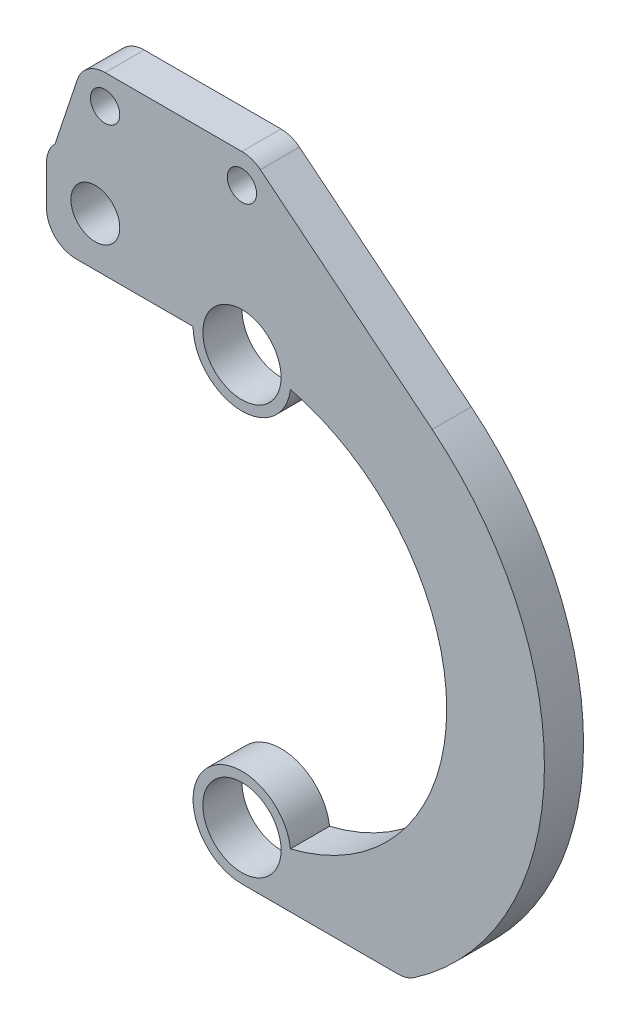
ISO-10303-21;
HEADER;
FILE_DESCRIPTION(('STEP AP214'),'2;1');
FILE_NAME('part.step','',(''),(''),'','','');
FILE_SCHEMA(('AUTOMOTIVE_DESIGN { 1 0 10303 214 1 1 1 1 }'));
ENDSEC;
DATA;
#1=APPLICATION_CONTEXT('core data for automotive mechanical design processes');
#2=APPLICATION_PROTOCOL_DEFINITION('international standard','automotive_design',2000,#1);
#3=PRODUCT_CONTEXT('',#1,'mechanical');
#4=PRODUCT('Part','Part','',(#3));
#5=PRODUCT_RELATED_PRODUCT_CATEGORY('part','',(#4));
#6=PRODUCT_DEFINITION_FORMATION('','',#4);
#7=PRODUCT_DEFINITION_CONTEXT('part definition',#1,'design');
#8=PRODUCT_DEFINITION('design','',#6,#7);
#9=PRODUCT_DEFINITION_SHAPE('','',#8);
#10=(LENGTH_UNIT() NAMED_UNIT(*) SI_UNIT(.MILLI.,.METRE.));
#11=(NAMED_UNIT(*) PLANE_ANGLE_UNIT() SI_UNIT($,.RADIAN.));
#12=(NAMED_UNIT(*) SI_UNIT($,.STERADIAN.) SOLID_ANGLE_UNIT());
#13=UNCERTAINTY_MEASURE_WITH_UNIT(LENGTH_MEASURE(1.E-05),#10,'distance_accuracy_value','');
#14=(GEOMETRIC_REPRESENTATION_CONTEXT(3) GLOBAL_UNCERTAINTY_ASSIGNED_CONTEXT((#13)) GLOBAL_UNIT_ASSIGNED_CONTEXT((#10,
#11,#12)) REPRESENTATION_CONTEXT('',''));
#15=CARTESIAN_POINT('',(0.,0.,0.));
#16=DIRECTION('',(0.,0.,1.));
#17=DIRECTION('',(1.,0.,0.));
#18=AXIS2_PLACEMENT_3D('',#15,#16,#17);
#19=CARTESIAN_POINT('',(-26.2297262447128,8.7412550388306,4.));
#20=DIRECTION('',(0.948704856693015,-0.316163082739092,0.));
#21=DIRECTION('',(0.316163082739092,0.948704856693015,0.));
#22=AXIS2_PLACEMENT_3D('',#19,#20,#21);
#23=PLANE('',#22);
#24=DIRECTION('',(-0.316163082739092,-0.948704856693015,0.));
#25=VECTOR('',#24,1.);
#26=CARTESIAN_POINT('',(-26.2297262447128,8.7412550388306,0.));
#27=LINE('',#26,#25);
#28=CARTESIAN_POINT('',(-16.846114570079,36.8984892482173,0.));
#29=VERTEX_POINT('',#28);
#30=CARTESIAN_POINT('',(-19.1213203435596,30.0713203435596,0.));
#31=VERTEX_POINT('',#30);
#32=EDGE_CURVE('E186',#29,#31,#27,.T.);
#33=ORIENTED_EDGE('',*,*,#32,.T.);
#34=DIRECTION('',(0.,0.,-1.));
#35=VECTOR('',#34,1.);
#36=CARTESIAN_POINT('',(-19.1213203435596,30.0713203435596,4.));
#37=LINE('',#36,#35);
#38=CARTESIAN_POINT('',(-19.1213203435596,30.0713203435596,4.));
#39=VERTEX_POINT('',#38);
#40=EDGE_CURVE('E11',#39,#31,#37,.T.);
#41=ORIENTED_EDGE('',*,*,#40,.F.);
#42=DIRECTION('',(-0.316163082739092,-0.948704856693015,0.));
#43=VECTOR('',#42,1.);
#44=CARTESIAN_POINT('',(-26.2297262447128,8.7412550388306,4.));
#45=LINE('',#44,#43);
#46=CARTESIAN_POINT('',(-16.846114570079,36.8984892482173,4.));
#47=VERTEX_POINT('',#46);
#48=EDGE_CURVE('E238',#47,#39,#45,.T.);
#49=ORIENTED_EDGE('',*,*,#48,.F.);
#50=DIRECTION('',(0.,0.,-1.));
#51=VECTOR('',#50,1.);
#52=CARTESIAN_POINT('',(-16.846114570079,36.8984892482173,4.));
#53=LINE('',#52,#51);
#54=EDGE_CURVE('E185',#47,#29,#53,.T.);
#55=ORIENTED_EDGE('',*,*,#54,.T.);
#56=EDGE_LOOP('',(#33,#41,#49,#55));
#57=FACE_BOUND('',#56,.T.);
#58=ADVANCED_FACE('F34',(#57),#23,.F.);
#59=CARTESIAN_POINT('',(-17.,27.95,4.));
#60=DIRECTION('',(0.,0.,-1.));
#61=DIRECTION('',(-1.,0.,0.));
#62=AXIS2_PLACEMENT_3D('',#59,#60,#61);
#63=CYLINDRICAL_SURFACE('',#62,3.);
#64=CARTESIAN_POINT('',(-17.,27.95,0.));
#65=DIRECTION('',(0.,0.,1.));
#66=DIRECTION('',(1.,0.,0.));
#67=AXIS2_PLACEMENT_3D('',#64,#65,#66);
#68=CIRCLE('',#67,3.);
#69=CARTESIAN_POINT('',(-20.,27.95,0.));
#70=VERTEX_POINT('',#69);
#71=EDGE_CURVE('E189',#31,#70,#68,.T.);
#72=ORIENTED_EDGE('',*,*,#71,.T.);
#73=DIRECTION('',(0.,0.,-1.));
#74=VECTOR('',#73,1.);
#75=CARTESIAN_POINT('',(-20.,27.95,4.));
#76=LINE('',#75,#74);
#77=CARTESIAN_POINT('',(-20.,27.95,4.));
#78=VERTEX_POINT('',#77);
#79=EDGE_CURVE('E42',#78,#70,#76,.T.);
#80=ORIENTED_EDGE('',*,*,#79,.F.);
#81=CARTESIAN_POINT('',(-17.,27.95,4.));
#82=DIRECTION('',(0.,0.,1.));
#83=DIRECTION('',(1.,0.,0.));
#84=AXIS2_PLACEMENT_3D('',#81,#82,#83);
#85=CIRCLE('',#84,3.);
#86=EDGE_CURVE('E110',#39,#78,#85,.T.);
#87=ORIENTED_EDGE('',*,*,#86,.F.);
#88=ORIENTED_EDGE('',*,*,#40,.T.);
#89=EDGE_LOOP('',(#72,#80,#87,#88));
#90=FACE_BOUND('',#89,.T.);
#91=ADVANCED_FACE('F268',(#90),#63,.T.);
#92=CARTESIAN_POINT('',(-20.,0.,4.));
#93=DIRECTION('',(-1.,0.,0.));
#94=DIRECTION('',(0.,0.,1.));
#95=AXIS2_PLACEMENT_3D('',#92,#93,#94);
#96=PLANE('',#95);
#97=DIRECTION('',(0.,1.,0.));
#98=VECTOR('',#97,1.);
#99=CARTESIAN_POINT('',(-20.,0.,0.));
#100=LINE('',#99,#98);
#101=CARTESIAN_POINT('',(-20.,23.95,0.));
#102=VERTEX_POINT('',#101);
#103=EDGE_CURVE('E192',#102,#70,#100,.T.);
#104=ORIENTED_EDGE('',*,*,#103,.F.);
#105=DIRECTION('',(0.,0.,-1.));
#106=VECTOR('',#105,1.);
#107=CARTESIAN_POINT('',(-20.,23.95,4.));
#108=LINE('',#107,#106);
#109=CARTESIAN_POINT('',(-20.,23.95,4.));
#110=VERTEX_POINT('',#109);
#111=EDGE_CURVE('E261',#110,#102,#108,.T.);
#112=ORIENTED_EDGE('',*,*,#111,.F.);
#113=DIRECTION('',(0.,1.,0.));
#114=VECTOR('',#113,1.);
#115=CARTESIAN_POINT('',(-20.,0.,4.));
#116=LINE('',#115,#114);
#117=EDGE_CURVE('E267',#110,#78,#116,.T.);
#118=ORIENTED_EDGE('',*,*,#117,.T.);
#119=ORIENTED_EDGE('',*,*,#79,.T.);
#120=EDGE_LOOP('',(#104,#112,#118,#119));
#121=FACE_BOUND('',#120,.T.);
#122=ADVANCED_FACE('F265',(#121),#96,.T.);
#123=CARTESIAN_POINT('',(-17.,23.95,4.));
#124=DIRECTION('',(0.,0.,-1.));
#125=DIRECTION('',(-1.,0.,0.));
#126=AXIS2_PLACEMENT_3D('',#123,#124,#125);
#127=CYLINDRICAL_SURFACE('',#126,3.);
#128=CARTESIAN_POINT('',(-17.,23.95,0.));
#129=DIRECTION('',(0.,0.,1.));
#130=DIRECTION('',(1.,0.,0.));
#131=AXIS2_PLACEMENT_3D('',#128,#129,#130);
#132=CIRCLE('',#131,3.);
#133=CARTESIAN_POINT('',(-17.,20.95,0.));
#134=VERTEX_POINT('',#133);
#135=EDGE_CURVE('E195',#134,#102,#132,.F.);
#136=ORIENTED_EDGE('',*,*,#135,.F.);
#137=DIRECTION('',(0.,0.,-1.));
#138=VECTOR('',#137,1.);
#139=CARTESIAN_POINT('',(-17.,20.95,4.));
#140=LINE('',#139,#138);
#141=CARTESIAN_POINT('',(-17.,20.95,4.));
#142=VERTEX_POINT('',#141);
#143=EDGE_CURVE('E259',#142,#134,#140,.T.);
#144=ORIENTED_EDGE('',*,*,#143,.F.);
#145=CARTESIAN_POINT('',(-17.,23.95,4.));
#146=DIRECTION('',(0.,0.,1.));
#147=DIRECTION('',(1.,0.,0.));
#148=AXIS2_PLACEMENT_3D('',#145,#146,#147);
#149=CIRCLE('',#148,3.);
#150=EDGE_CURVE('E281',#142,#110,#149,.F.);
#151=ORIENTED_EDGE('',*,*,#150,.T.);
#152=ORIENTED_EDGE('',*,*,#111,.T.);
#153=EDGE_LOOP('',(#136,#144,#151,#152));
#154=FACE_BOUND('',#153,.T.);
#155=ADVANCED_FACE('F278',(#154),#127,.T.);
#156=CARTESIAN_POINT('',(0.,20.95,4.));
#157=DIRECTION('',(0.,-1.,0.));
#158=DIRECTION('',(1.,0.,0.));
#159=AXIS2_PLACEMENT_3D('',#156,#157,#158);
#160=PLANE('',#159);
#161=DIRECTION('',(-1.,0.,0.));
#162=VECTOR('',#161,1.);
#163=CARTESIAN_POINT('',(0.,20.95,0.));
#164=LINE('',#163,#162);
#165=CARTESIAN_POINT('',(-5.,20.95,0.));
#166=VERTEX_POINT('',#165);
#167=EDGE_CURVE('E198',#166,#134,#164,.T.);
#168=ORIENTED_EDGE('',*,*,#167,.F.);
#169=DIRECTION('',(0.,0.,-1.));
#170=VECTOR('',#169,1.);
#171=CARTESIAN_POINT('',(-5.,20.95,4.));
#172=LINE('',#171,#170);
#173=CARTESIAN_POINT('',(-5.,20.95,4.));
#174=VERTEX_POINT('',#173);
#175=EDGE_CURVE('E257',#174,#166,#172,.T.);
#176=ORIENTED_EDGE('',*,*,#175,.F.);
#177=DIRECTION('',(-1.,0.,0.));
#178=VECTOR('',#177,1.);
#179=CARTESIAN_POINT('',(0.,20.95,4.));
#180=LINE('',#179,#178);
#181=EDGE_CURVE('E285',#174,#142,#180,.T.);
#182=ORIENTED_EDGE('',*,*,#181,.T.);
#183=ORIENTED_EDGE('',*,*,#143,.T.);
#184=EDGE_LOOP('',(#168,#176,#182,#183));
#185=FACE_BOUND('',#184,.T.);
#186=ADVANCED_FACE('F336',(#185),#160,.T.);
#187=CARTESIAN_POINT('',(0.,20.95,4.));
#188=DIRECTION('',(0.,0.,-1.));
#189=DIRECTION('',(-1.,0.,0.));
#190=AXIS2_PLACEMENT_3D('',#187,#188,#189);
#191=CYLINDRICAL_SURFACE('',#190,5.);
#192=CARTESIAN_POINT('',(0.,20.95,0.));
#193=DIRECTION('',(0.,0.,1.));
#194=DIRECTION('',(1.,0.,0.));
#195=AXIS2_PLACEMENT_3D('',#192,#193,#194);
#196=CIRCLE('',#195,5.);
#197=CARTESIAN_POINT('',(4.96427219059639,20.3533412887828,0.));
#198=VERTEX_POINT('',#197);
#199=EDGE_CURVE('E201',#166,#198,#196,.T.);
#200=ORIENTED_EDGE('',*,*,#199,.T.);
#201=DIRECTION('',(0.,0.,-1.));
#202=VECTOR('',#201,1.);
#203=CARTESIAN_POINT('',(4.96427219059639,20.3533412887828,4.));
#204=LINE('',#203,#202);
#205=CARTESIAN_POINT('',(4.96427219059639,20.3533412887828,4.));
#206=VERTEX_POINT('',#205);
#207=EDGE_CURVE('E255',#206,#198,#204,.T.);
#208=ORIENTED_EDGE('',*,*,#207,.F.);
#209=CARTESIAN_POINT('',(0.,20.95,4.));
#210=DIRECTION('',(0.,0.,1.));
#211=DIRECTION('',(1.,0.,0.));
#212=AXIS2_PLACEMENT_3D('',#209,#210,#211);
#213=CIRCLE('',#212,5.);
#214=EDGE_CURVE('E291',#174,#206,#213,.T.);
#215=ORIENTED_EDGE('',*,*,#214,.F.);
#216=ORIENTED_EDGE('',*,*,#175,.T.);
#217=EDGE_LOOP('',(#200,#208,#215,#216));
#218=FACE_BOUND('',#217,.T.);
#219=ADVANCED_FACE('F339',(#218),#191,.T.);
#220=CARTESIAN_POINT('',(0.,0.,4.));
#221=DIRECTION('',(0.,0.,-1.));
#222=DIRECTION('',(-1.,0.,0.));
#223=AXIS2_PLACEMENT_3D('',#220,#221,#222);
#224=CYLINDRICAL_SURFACE('',#223,20.95);
#225=CARTESIAN_POINT('',(0.,0.,0.));
#226=DIRECTION('',(0.,0.,1.));
#227=DIRECTION('',(1.,0.,0.));
#228=AXIS2_PLACEMENT_3D('',#225,#226,#227);
#229=CIRCLE('',#228,20.95);
#230=CARTESIAN_POINT('',(4.96427219059625,-20.3533412887829,0.));
#231=VERTEX_POINT('',#230);
#232=EDGE_CURVE('E204',#231,#198,#229,.T.);
#233=ORIENTED_EDGE('',*,*,#232,.F.);
#234=DIRECTION('',(0.,0.,-1.));
#235=VECTOR('',#234,1.);
#236=CARTESIAN_POINT('',(4.96427219059625,-20.3533412887829,4.));
#237=LINE('',#236,#235);
#238=CARTESIAN_POINT('',(4.96427219059625,-20.3533412887829,4.));
#239=VERTEX_POINT('',#238);
#240=EDGE_CURVE('E253',#239,#231,#237,.T.);
#241=ORIENTED_EDGE('',*,*,#240,.F.);
#242=CARTESIAN_POINT('',(0.,0.,4.));
#243=DIRECTION('',(0.,0.,1.));
#244=DIRECTION('',(1.,0.,0.));
#245=AXIS2_PLACEMENT_3D('',#242,#243,#244);
#246=CIRCLE('',#245,20.95);
#247=EDGE_CURVE('E293',#239,#206,#246,.T.);
#248=ORIENTED_EDGE('',*,*,#247,.T.);
#249=ORIENTED_EDGE('',*,*,#207,.T.);
#250=EDGE_LOOP('',(#233,#241,#248,#249));
#251=FACE_BOUND('',#250,.T.);
#252=ADVANCED_FACE('F343',(#251),#224,.F.);
#253=CARTESIAN_POINT('',(-1.46293068097527E-13,-20.95,4.));
#254=DIRECTION('',(0.,0.,-1.));
#255=DIRECTION('',(-1.,0.,0.));
#256=AXIS2_PLACEMENT_3D('',#253,#254,#255);
#257=CYLINDRICAL_SURFACE('',#256,5.);
#258=CARTESIAN_POINT('',(-1.46293068097527E-13,-20.95,0.));
#259=DIRECTION('',(0.,0.,1.));
#260=DIRECTION('',(1.,0.,0.));
#261=AXIS2_PLACEMENT_3D('',#258,#259,#260);
#262=CIRCLE('',#261,5.);
#263=CARTESIAN_POINT('',(-1.63750471515078E-13,-25.95,0.));
#264=VERTEX_POINT('',#263);
#265=EDGE_CURVE('E207',#231,#264,#262,.T.);
#266=ORIENTED_EDGE('',*,*,#265,.T.);
#267=DIRECTION('',(0.,0.,-1.));
#268=VECTOR('',#267,1.);
#269=CARTESIAN_POINT('',(-1.63750471515078E-13,-25.95,4.));
#270=LINE('',#269,#268);
#271=CARTESIAN_POINT('',(-1.63750471515078E-13,-25.95,4.));
#272=VERTEX_POINT('',#271);
#273=EDGE_CURVE('E250',#272,#264,#270,.T.);
#274=ORIENTED_EDGE('',*,*,#273,.F.);
#275=CARTESIAN_POINT('',(-1.46293068097527E-13,-20.95,4.));
#276=DIRECTION('',(0.,0.,1.));
#277=DIRECTION('',(1.,0.,0.));
#278=AXIS2_PLACEMENT_3D('',#275,#276,#277);
#279=CIRCLE('',#278,5.);
#280=EDGE_CURVE('E296',#239,#272,#279,.T.);
#281=ORIENTED_EDGE('',*,*,#280,.F.);
#282=ORIENTED_EDGE('',*,*,#240,.T.);
#283=EDGE_LOOP('',(#266,#274,#281,#282));
#284=FACE_BOUND('',#283,.T.);
#285=ADVANCED_FACE('F347',(#284),#257,.T.);
#286=CARTESIAN_POINT('',(0.,-25.95,4.));
#287=DIRECTION('',(0.,1.,0.));
#288=DIRECTION('',(-1.,0.,0.));
#289=AXIS2_PLACEMENT_3D('',#286,#287,#288);
#290=PLANE('',#289);
#291=DIRECTION('',(1.,0.,0.));
#292=VECTOR('',#291,1.);
#293=CARTESIAN_POINT('',(0.,-25.95,0.));
#294=LINE('',#293,#292);
#295=CARTESIAN_POINT('',(15.9530561335437,-25.9500000000001,0.));
#296=VERTEX_POINT('',#295);
#297=EDGE_CURVE('E209',#264,#296,#294,.T.);
#298=ORIENTED_EDGE('',*,*,#297,.T.);
#299=DIRECTION('',(0.,0.,-1.));
#300=VECTOR('',#299,1.);
#301=CARTESIAN_POINT('',(15.9530561335437,-25.9500000000001,4.));
#302=LINE('',#301,#300);
#303=CARTESIAN_POINT('',(15.9530561335437,-25.9500000000001,4.));
#304=VERTEX_POINT('',#303);
#305=EDGE_CURVE('E247',#304,#296,#302,.T.);
#306=ORIENTED_EDGE('',*,*,#305,.F.);
#307=DIRECTION('',(1.,0.,0.));
#308=VECTOR('',#307,1.);
#309=CARTESIAN_POINT('',(0.,-25.95,4.));
#310=LINE('',#309,#308);
#311=EDGE_CURVE('E298',#272,#304,#310,.T.);
#312=ORIENTED_EDGE('',*,*,#311,.F.);
#313=ORIENTED_EDGE('',*,*,#273,.T.);
#314=EDGE_LOOP('',(#298,#306,#312,#313));
#315=FACE_BOUND('',#314,.T.);
#316=ADVANCED_FACE('F351',(#315),#290,.F.);
#317=CARTESIAN_POINT('',(15.9530561335437,-22.9500000000001,4.));
#318=DIRECTION('',(0.,0.,-1.));
#319=DIRECTION('',(-1.,0.,0.));
#320=AXIS2_PLACEMENT_3D('',#317,#318,#319);
#321=CYLINDRICAL_SURFACE('',#320,3.);
#322=CARTESIAN_POINT('',(15.9530561335437,-22.9500000000001,0.));
#323=DIRECTION('',(0.,0.,1.));
#324=DIRECTION('',(1.,0.,0.));
#325=AXIS2_PLACEMENT_3D('',#322,#323,#324);
#326=CIRCLE('',#325,3.);
#327=CARTESIAN_POINT('',(17.6653698509187,-25.4133273703042,0.));
#328=VERTEX_POINT('',#327);
#329=EDGE_CURVE('E211',#296,#328,#326,.T.);
#330=ORIENTED_EDGE('',*,*,#329,.T.);
#331=DIRECTION('',(0.,0.,-1.));
#332=VECTOR('',#331,1.);
#333=CARTESIAN_POINT('',(17.6653698509187,-25.4133273703042,4.));
#334=LINE('',#333,#332);
#335=CARTESIAN_POINT('',(17.6653698509187,-25.4133273703042,4.));
#336=VERTEX_POINT('',#335);
#337=EDGE_CURVE('E244',#336,#328,#334,.T.);
#338=ORIENTED_EDGE('',*,*,#337,.F.);
#339=CARTESIAN_POINT('',(15.9530561335437,-22.9500000000001,4.));
#340=DIRECTION('',(0.,0.,1.));
#341=DIRECTION('',(1.,0.,0.));
#342=AXIS2_PLACEMENT_3D('',#339,#340,#341);
#343=CIRCLE('',#342,3.);
#344=EDGE_CURVE('E300',#304,#336,#343,.T.);
#345=ORIENTED_EDGE('',*,*,#344,.F.);
#346=ORIENTED_EDGE('',*,*,#305,.T.);
#347=EDGE_LOOP('',(#330,#338,#345,#346));
#348=FACE_BOUND('',#347,.T.);
#349=ADVANCED_FACE('F355',(#348),#321,.T.);
#350=CARTESIAN_POINT('',(0.,0.,4.));
#351=DIRECTION('',(0.,0.,-1.));
#352=DIRECTION('',(-1.,0.,0.));
#353=AXIS2_PLACEMENT_3D('',#350,#351,#352);
#354=CYLINDRICAL_SURFACE('',#353,30.95);
#355=CARTESIAN_POINT('',(0.,0.,0.));
#356=DIRECTION('',(0.,0.,1.));
#357=DIRECTION('',(1.,0.,0.));
#358=AXIS2_PLACEMENT_3D('',#355,#356,#357);
#359=CIRCLE('',#358,30.95);
#360=CARTESIAN_POINT('',(19.4651242928461,24.0626564673157,0.));
#361=VERTEX_POINT('',#360);
#362=EDGE_CURVE('E213',#328,#361,#359,.T.);
#363=ORIENTED_EDGE('',*,*,#362,.T.);
#364=DIRECTION('',(0.,0.,-1.));
#365=VECTOR('',#364,1.);
#366=CARTESIAN_POINT('',(19.4651242928461,24.0626564673157,4.));
#367=LINE('',#366,#365);
#368=CARTESIAN_POINT('',(19.4651242928461,24.0626564673157,4.));
#369=VERTEX_POINT('',#368);
#370=EDGE_CURVE('E242',#369,#361,#367,.T.);
#371=ORIENTED_EDGE('',*,*,#370,.F.);
#372=CARTESIAN_POINT('',(0.,0.,4.));
#373=DIRECTION('',(0.,0.,1.));
#374=DIRECTION('',(1.,0.,0.));
#375=AXIS2_PLACEMENT_3D('',#372,#373,#374);
#376=CIRCLE('',#375,30.95);
#377=EDGE_CURVE('E302',#336,#369,#376,.T.);
#378=ORIENTED_EDGE('',*,*,#377,.F.);
#379=ORIENTED_EDGE('',*,*,#337,.T.);
#380=EDGE_LOOP('',(#363,#371,#378,#379));
#381=FACE_BOUND('',#380,.T.);
#382=ADVANCED_FACE('F359',(#381),#354,.T.);
#383=CARTESIAN_POINT('',(19.4651242928461,24.0626564673157,4.));
#384=DIRECTION('',(0.628921624970796,0.777468706536857,0.));
#385=DIRECTION('',(-0.777468706536857,0.628921624970796,0.));
#386=AXIS2_PLACEMENT_3D('',#383,#384,#385);
#387=PLANE('',#386);
#388=DIRECTION('',(0.777468706536857,-0.628921624970796,0.));
#389=VECTOR('',#388,1.);
#390=CARTESIAN_POINT('',(19.4651242928461,24.0626564673157,0.));
#391=LINE('',#390,#389);
#392=CARTESIAN_POINT('',(1.88676487491238,38.2824061196106,0.));
#393=VERTEX_POINT('',#392);
#394=EDGE_CURVE('E216',#393,#361,#391,.T.);
#395=ORIENTED_EDGE('',*,*,#394,.F.);
#396=DIRECTION('',(0.,0.,-1.));
#397=VECTOR('',#396,1.);
#398=CARTESIAN_POINT('',(1.88676487491238,38.2824061196106,4.));
#399=LINE('',#398,#397);
#400=CARTESIAN_POINT('',(1.88676487491238,38.2824061196106,4.));
#401=VERTEX_POINT('',#400);
#402=EDGE_CURVE('E163',#401,#393,#399,.T.);
#403=ORIENTED_EDGE('',*,*,#402,.F.);
#404=DIRECTION('',(0.777468706536857,-0.628921624970796,0.));
#405=VECTOR('',#404,1.);
#406=CARTESIAN_POINT('',(19.4651242928461,24.0626564673157,4.));
#407=LINE('',#406,#405);
#408=EDGE_CURVE('E152',#401,#369,#407,.T.);
#409=ORIENTED_EDGE('',*,*,#408,.T.);
#410=ORIENTED_EDGE('',*,*,#370,.T.);
#411=EDGE_LOOP('',(#395,#403,#409,#410));
#412=FACE_BOUND('',#411,.T.);
#413=ADVANCED_FACE('F305',(#412),#387,.T.);
#414=CARTESIAN_POINT('',(0.,35.95,4.));
#415=DIRECTION('',(0.,0.,-1.));
#416=DIRECTION('',(-1.,0.,0.));
#417=AXIS2_PLACEMENT_3D('',#414,#415,#416);
#418=CYLINDRICAL_SURFACE('',#417,3.);
#419=CARTESIAN_POINT('',(0.,35.95,0.));
#420=DIRECTION('',(0.,0.,1.));
#421=DIRECTION('',(1.,0.,0.));
#422=AXIS2_PLACEMENT_3D('',#419,#420,#421);
#423=CIRCLE('',#422,3.);
#424=CARTESIAN_POINT('',(0.,38.95,0.));
#425=VERTEX_POINT('',#424);
#426=EDGE_CURVE('E159',#393,#425,#423,.T.);
#427=ORIENTED_EDGE('',*,*,#426,.T.);
#428=DIRECTION('',(0.,0.,-1.));
#429=VECTOR('',#428,1.);
#430=CARTESIAN_POINT('',(0.,38.95,4.));
#431=LINE('',#430,#429);
#432=CARTESIAN_POINT('',(0.,38.95,4.));
#433=VERTEX_POINT('',#432);
#434=EDGE_CURVE('E156',#433,#425,#431,.T.);
#435=ORIENTED_EDGE('',*,*,#434,.F.);
#436=CARTESIAN_POINT('',(0.,35.95,4.));
#437=DIRECTION('',(0.,0.,1.));
#438=DIRECTION('',(1.,0.,0.));
#439=AXIS2_PLACEMENT_3D('',#436,#437,#438);
#440=CIRCLE('',#439,3.);
#441=EDGE_CURVE('E145',#401,#433,#440,.T.);
#442=ORIENTED_EDGE('',*,*,#441,.F.);
#443=ORIENTED_EDGE('',*,*,#402,.T.);
#444=EDGE_LOOP('',(#427,#435,#442,#443));
#445=FACE_BOUND('',#444,.T.);
#446=ADVANCED_FACE('F157',(#445),#418,.T.);
#447=CARTESIAN_POINT('',(0.,38.95,4.));
#448=DIRECTION('',(0.,1.,0.));
#449=DIRECTION('',(0.,0.,1.));
#450=AXIS2_PLACEMENT_3D('',#447,#448,#449);
#451=PLANE('',#450);
#452=DIRECTION('',(1.,0.,0.));
#453=VECTOR('',#452,1.);
#454=CARTESIAN_POINT('',(0.,38.95,0.));
#455=LINE('',#454,#453);
#456=CARTESIAN_POINT('',(-14.,38.95,0.));
#457=VERTEX_POINT('',#456);
#458=EDGE_CURVE('E220',#457,#425,#455,.T.);
#459=ORIENTED_EDGE('',*,*,#458,.F.);
#460=DIRECTION('',(0.,0.,-1.));
#461=VECTOR('',#460,1.);
#462=CARTESIAN_POINT('',(-14.,38.95,4.));
#463=LINE('',#462,#461);
#464=CARTESIAN_POINT('',(-14.,38.95,4.));
#465=VERTEX_POINT('',#464);
#466=EDGE_CURVE('E99',#465,#457,#463,.T.);
#467=ORIENTED_EDGE('',*,*,#466,.F.);
#468=DIRECTION('',(1.,0.,0.));
#469=VECTOR('',#468,1.);
#470=CARTESIAN_POINT('',(0.,38.95,4.));
#471=LINE('',#470,#469);
#472=EDGE_CURVE('E150',#465,#433,#471,.T.);
#473=ORIENTED_EDGE('',*,*,#472,.T.);
#474=ORIENTED_EDGE('',*,*,#434,.T.);
#475=EDGE_LOOP('',(#459,#467,#473,#474));
#476=FACE_BOUND('',#475,.T.);
#477=ADVANCED_FACE('F165',(#476),#451,.T.);
#478=CARTESIAN_POINT('',(-14.,35.95,4.));
#479=DIRECTION('',(0.,0.,-1.));
#480=DIRECTION('',(-1.,0.,0.));
#481=AXIS2_PLACEMENT_3D('',#478,#479,#480);
#482=CYLINDRICAL_SURFACE('',#481,1.5);
#483=CARTESIAN_POINT('',(-14.,35.95,4.));
#484=DIRECTION('',(0.,0.,1.));
#485=DIRECTION('',(1.,0.,0.));
#486=AXIS2_PLACEMENT_3D('',#483,#484,#485);
#487=CIRCLE('',#486,1.5);
#488=CARTESIAN_POINT('',(-12.5,35.95,4.));
#489=VERTEX_POINT('',#488);
#490=EDGE_CURVE('E179',#489,#489,#487,.T.);
#491=ORIENTED_EDGE('',*,*,#490,.T.);
#492=EDGE_LOOP('',(#491));
#493=FACE_BOUND('',#492,.T.);
#494=CARTESIAN_POINT('',(-14.,35.95,0.));
#495=DIRECTION('',(0.,0.,1.));
#496=DIRECTION('',(1.,0.,0.));
#497=AXIS2_PLACEMENT_3D('',#494,#495,#496);
#498=CIRCLE('',#497,1.5);
#499=CARTESIAN_POINT('',(-12.5,35.95,0.));
#500=VERTEX_POINT('',#499);
#501=EDGE_CURVE('E232',#500,#500,#498,.T.);
#502=ORIENTED_EDGE('',*,*,#501,.F.);
#503=EDGE_LOOP('',(#502));
#504=FACE_BOUND('',#503,.T.);
#505=ADVANCED_FACE('F368',(#493,#504),#482,.F.);
#506=CARTESIAN_POINT('',(-15.,25.95,4.));
#507=DIRECTION('',(0.,0.,-1.));
#508=DIRECTION('',(-1.,0.,0.));
#509=AXIS2_PLACEMENT_3D('',#506,#507,#508);
#510=CYLINDRICAL_SURFACE('',#509,2.5);
#511=CARTESIAN_POINT('',(-15.,25.95,4.));
#512=DIRECTION('',(0.,0.,1.));
#513=DIRECTION('',(1.,0.,0.));
#514=AXIS2_PLACEMENT_3D('',#511,#512,#513);
#515=CIRCLE('',#514,2.5);
#516=CARTESIAN_POINT('',(-12.5,25.95,4.));
#517=VERTEX_POINT('',#516);
#518=EDGE_CURVE('E176',#517,#517,#515,.T.);
#519=ORIENTED_EDGE('',*,*,#518,.T.);
#520=EDGE_LOOP('',(#519));
#521=FACE_BOUND('',#520,.T.);
#522=CARTESIAN_POINT('',(-15.,25.95,0.));
#523=DIRECTION('',(0.,0.,1.));
#524=DIRECTION('',(1.,0.,0.));
#525=AXIS2_PLACEMENT_3D('',#522,#523,#524);
#526=CIRCLE('',#525,2.5);
#527=CARTESIAN_POINT('',(-12.5,25.95,0.));
#528=VERTEX_POINT('',#527);
#529=EDGE_CURVE('E229',#528,#528,#526,.T.);
#530=ORIENTED_EDGE('',*,*,#529,.F.);
#531=EDGE_LOOP('',(#530));
#532=FACE_BOUND('',#531,.T.);
#533=ADVANCED_FACE('F372',(#521,#532),#510,.F.);
#534=CARTESIAN_POINT('',(-1.46293068097527E-13,-20.95,4.));
#535=DIRECTION('',(0.,0.,-1.));
#536=DIRECTION('',(-1.,0.,0.));
#537=AXIS2_PLACEMENT_3D('',#534,#535,#536);
#538=CYLINDRICAL_SURFACE('',#537,4.);
#539=CARTESIAN_POINT('',(-1.46293068097527E-13,-20.95,4.));
#540=DIRECTION('',(0.,0.,1.));
#541=DIRECTION('',(1.,0.,0.));
#542=AXIS2_PLACEMENT_3D('',#539,#540,#541);
#543=CIRCLE('',#542,4.);
#544=CARTESIAN_POINT('',(3.99999999999986,-20.95,4.));
#545=VERTEX_POINT('',#544);
#546=EDGE_CURVE('E173',#545,#545,#543,.T.);
#547=ORIENTED_EDGE('',*,*,#546,.T.);
#548=EDGE_LOOP('',(#547));
#549=FACE_BOUND('',#548,.T.);
#550=CARTESIAN_POINT('',(-1.46293068097527E-13,-20.95,0.));
#551=DIRECTION('',(0.,0.,1.));
#552=DIRECTION('',(1.,0.,0.));
#553=AXIS2_PLACEMENT_3D('',#550,#551,#552);
#554=CIRCLE('',#553,4.);
#555=CARTESIAN_POINT('',(3.99999999999986,-20.95,0.));
#556=VERTEX_POINT('',#555);
#557=EDGE_CURVE('E226',#556,#556,#554,.T.);
#558=ORIENTED_EDGE('',*,*,#557,.F.);
#559=EDGE_LOOP('',(#558));
#560=FACE_BOUND('',#559,.T.);
#561=ADVANCED_FACE('F321',(#549,#560),#538,.F.);
#562=CARTESIAN_POINT('',(0.,20.95,4.));
#563=DIRECTION('',(0.,0.,-1.));
#564=DIRECTION('',(-1.,0.,0.));
#565=AXIS2_PLACEMENT_3D('',#562,#563,#564);
#566=CYLINDRICAL_SURFACE('',#565,4.);
#567=CARTESIAN_POINT('',(0.,20.95,4.));
#568=DIRECTION('',(0.,0.,1.));
#569=DIRECTION('',(1.,0.,0.));
#570=AXIS2_PLACEMENT_3D('',#567,#568,#569);
#571=CIRCLE('',#570,4.);
#572=CARTESIAN_POINT('',(4.,20.95,4.));
#573=VERTEX_POINT('',#572);
#574=EDGE_CURVE('E167',#573,#573,#571,.T.);
#575=ORIENTED_EDGE('',*,*,#574,.T.);
#576=EDGE_LOOP('',(#575));
#577=FACE_BOUND('',#576,.T.);
#578=CARTESIAN_POINT('',(0.,20.95,0.));
#579=DIRECTION('',(0.,0.,1.));
#580=DIRECTION('',(1.,0.,0.));
#581=AXIS2_PLACEMENT_3D('',#578,#579,#580);
#582=CIRCLE('',#581,4.);
#583=CARTESIAN_POINT('',(4.,20.95,0.));
#584=VERTEX_POINT('',#583);
#585=EDGE_CURVE('E223',#584,#584,#582,.T.);
#586=ORIENTED_EDGE('',*,*,#585,.F.);
#587=EDGE_LOOP('',(#586));
#588=FACE_BOUND('',#587,.T.);
#589=ADVANCED_FACE('F313',(#577,#588),#566,.F.);
#590=CARTESIAN_POINT('',(-14.,35.95,4.));
#591=DIRECTION('',(0.,0.,-1.));
#592=DIRECTION('',(-1.,0.,0.));
#593=AXIS2_PLACEMENT_3D('',#590,#591,#592);
#594=CYLINDRICAL_SURFACE('',#593,3.);
#595=CARTESIAN_POINT('',(-14.,35.95,0.));
#596=DIRECTION('',(0.,0.,1.));
#597=DIRECTION('',(1.,0.,0.));
#598=AXIS2_PLACEMENT_3D('',#595,#596,#597);
#599=CIRCLE('',#598,3.);
#600=EDGE_CURVE('E102',#457,#29,#599,.T.);
#601=ORIENTED_EDGE('',*,*,#600,.T.);
#602=ORIENTED_EDGE('',*,*,#54,.F.);
#603=CARTESIAN_POINT('',(-14.,35.95,4.));
#604=DIRECTION('',(0.,0.,1.));
#605=DIRECTION('',(1.,0.,0.));
#606=AXIS2_PLACEMENT_3D('',#603,#604,#605);
#607=CIRCLE('',#606,3.);
#608=EDGE_CURVE('E50',#465,#47,#607,.T.);
#609=ORIENTED_EDGE('',*,*,#608,.F.);
#610=ORIENTED_EDGE('',*,*,#466,.T.);
#611=EDGE_LOOP('',(#601,#602,#609,#610));
#612=FACE_BOUND('',#611,.T.);
#613=ADVANCED_FACE('F310',(#612),#594,.T.);
#614=CARTESIAN_POINT('',(0.,35.95,4.));
#615=DIRECTION('',(0.,0.,-1.));
#616=DIRECTION('',(-1.,0.,0.));
#617=AXIS2_PLACEMENT_3D('',#614,#615,#616);
#618=CYLINDRICAL_SURFACE('',#617,1.5);
#619=CARTESIAN_POINT('',(0.,35.95,4.));
#620=DIRECTION('',(0.,0.,1.));
#621=DIRECTION('',(1.,0.,0.));
#622=AXIS2_PLACEMENT_3D('',#619,#620,#621);
#623=CIRCLE('',#622,1.5);
#624=CARTESIAN_POINT('',(1.5,35.95,4.));
#625=VERTEX_POINT('',#624);
#626=EDGE_CURVE('E182',#625,#625,#623,.T.);
#627=ORIENTED_EDGE('',*,*,#626,.T.);
#628=EDGE_LOOP('',(#627));
#629=FACE_BOUND('',#628,.T.);
#630=CARTESIAN_POINT('',(0.,35.95,0.));
#631=DIRECTION('',(0.,0.,1.));
#632=DIRECTION('',(1.,0.,0.));
#633=AXIS2_PLACEMENT_3D('',#630,#631,#632);
#634=CIRCLE('',#633,1.5);
#635=CARTESIAN_POINT('',(1.5,35.95,0.));
#636=VERTEX_POINT('',#635);
#637=EDGE_CURVE('E235',#636,#636,#634,.T.);
#638=ORIENTED_EDGE('',*,*,#637,.F.);
#639=EDGE_LOOP('',(#638));
#640=FACE_BOUND('',#639,.T.);
#641=ADVANCED_FACE('F312',(#629,#640),#618,.F.);
#642=CARTESIAN_POINT('',(0.,0.,4.));
#643=DIRECTION('',(0.,0.,1.));
#644=DIRECTION('',(1.,0.,0.));
#645=AXIS2_PLACEMENT_3D('',#642,#643,#644);
#646=PLANE('',#645);
#647=ORIENTED_EDGE('',*,*,#48,.T.);
#648=ORIENTED_EDGE('',*,*,#86,.T.);
#649=ORIENTED_EDGE('',*,*,#117,.F.);
#650=ORIENTED_EDGE('',*,*,#150,.F.);
#651=ORIENTED_EDGE('',*,*,#181,.F.);
#652=ORIENTED_EDGE('',*,*,#214,.T.);
#653=ORIENTED_EDGE('',*,*,#247,.F.);
#654=ORIENTED_EDGE('',*,*,#280,.T.);
#655=ORIENTED_EDGE('',*,*,#311,.T.);
#656=ORIENTED_EDGE('',*,*,#344,.T.);
#657=ORIENTED_EDGE('',*,*,#377,.T.);
#658=ORIENTED_EDGE('',*,*,#408,.F.);
#659=ORIENTED_EDGE('',*,*,#441,.T.);
#660=ORIENTED_EDGE('',*,*,#472,.F.);
#661=ORIENTED_EDGE('',*,*,#608,.T.);
#662=EDGE_LOOP('',(#647,#648,#649,#650,#651,#652,#653,#654,#655,#656,#657,#658,#659,#660,#661));
#663=FACE_BOUND('',#662,.T.);
#664=ORIENTED_EDGE('',*,*,#574,.F.);
#665=EDGE_LOOP('',(#664));
#666=FACE_BOUND('',#665,.T.);
#667=ORIENTED_EDGE('',*,*,#546,.F.);
#668=EDGE_LOOP('',(#667));
#669=FACE_BOUND('',#668,.T.);
#670=ORIENTED_EDGE('',*,*,#518,.F.);
#671=EDGE_LOOP('',(#670));
#672=FACE_BOUND('',#671,.T.);
#673=ORIENTED_EDGE('',*,*,#490,.F.);
#674=EDGE_LOOP('',(#673));
#675=FACE_BOUND('',#674,.T.);
#676=ORIENTED_EDGE('',*,*,#626,.F.);
#677=EDGE_LOOP('',(#676));
#678=FACE_BOUND('',#677,.T.);
#679=ADVANCED_FACE('F147',(#663,#666,#669,#672,#675,#678),#646,.T.);
#680=CARTESIAN_POINT('',(0.,0.,0.));
#681=DIRECTION('',(0.,0.,1.));
#682=DIRECTION('',(1.,0.,0.));
#683=AXIS2_PLACEMENT_3D('',#680,#681,#682);
#684=PLANE('',#683);
#685=ORIENTED_EDGE('',*,*,#32,.F.);
#686=ORIENTED_EDGE('',*,*,#600,.F.);
#687=ORIENTED_EDGE('',*,*,#458,.T.);
#688=ORIENTED_EDGE('',*,*,#426,.F.);
#689=ORIENTED_EDGE('',*,*,#394,.T.);
#690=ORIENTED_EDGE('',*,*,#362,.F.);
#691=ORIENTED_EDGE('',*,*,#329,.F.);
#692=ORIENTED_EDGE('',*,*,#297,.F.);
#693=ORIENTED_EDGE('',*,*,#265,.F.);
#694=ORIENTED_EDGE('',*,*,#232,.T.);
#695=ORIENTED_EDGE('',*,*,#199,.F.);
#696=ORIENTED_EDGE('',*,*,#167,.T.);
#697=ORIENTED_EDGE('',*,*,#135,.T.);
#698=ORIENTED_EDGE('',*,*,#103,.T.);
#699=ORIENTED_EDGE('',*,*,#71,.F.);
#700=EDGE_LOOP('',(#685,#686,#687,#688,#689,#690,#691,#692,#693,#694,#695,#696,#697,#698,#699));
#701=FACE_BOUND('',#700,.T.);
#702=ORIENTED_EDGE('',*,*,#585,.T.);
#703=EDGE_LOOP('',(#702));
#704=FACE_BOUND('',#703,.T.);
#705=ORIENTED_EDGE('',*,*,#557,.T.);
#706=EDGE_LOOP('',(#705));
#707=FACE_BOUND('',#706,.T.);
#708=ORIENTED_EDGE('',*,*,#529,.T.);
#709=EDGE_LOOP('',(#708));
#710=FACE_BOUND('',#709,.T.);
#711=ORIENTED_EDGE('',*,*,#501,.T.);
#712=EDGE_LOOP('',(#711));
#713=FACE_BOUND('',#712,.T.);
#714=ORIENTED_EDGE('',*,*,#637,.T.);
#715=EDGE_LOOP('',(#714));
#716=FACE_BOUND('',#715,.T.);
#717=ADVANCED_FACE('F272',(#701,#704,#707,#710,#713,#716),#684,.F.);
#718=CLOSED_SHELL('',(#58,#91,#122,#155,#186,#219,#252,#285,#316,#349,#382,#413,#446,#477,#505,
#533,#561,#589,#613,#641,#679,#717));
#719=MANIFOLD_SOLID_BREP('B2',#718);
#720=ADVANCED_BREP_SHAPE_REPRESENTATION('',(#18,#719),#14);
#721=SHAPE_DEFINITION_REPRESENTATION(#9,#720);
ENDSEC;
END-ISO-10303-21;
